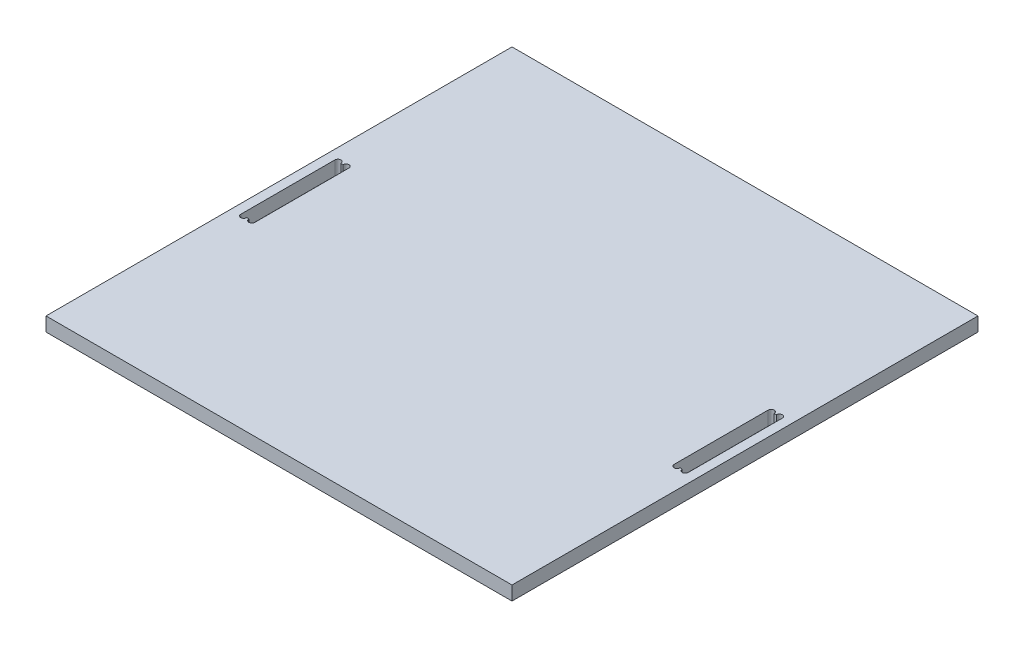
ISO-10303-21;
HEADER;
FILE_DESCRIPTION(('STEP AP214'),'2;1');
FILE_NAME('part.step','',(''),(''),'','','');
FILE_SCHEMA(('AUTOMOTIVE_DESIGN { 1 0 10303 214 1 1 1 1 }'));
ENDSEC;
DATA;
#1=APPLICATION_CONTEXT('core data for automotive mechanical design processes');
#2=APPLICATION_PROTOCOL_DEFINITION('international standard','automotive_design',2000,#1);
#3=PRODUCT_CONTEXT('',#1,'mechanical');
#4=PRODUCT('Part','Part','',(#3));
#5=PRODUCT_RELATED_PRODUCT_CATEGORY('part','',(#4));
#6=PRODUCT_DEFINITION_FORMATION('','',#4);
#7=PRODUCT_DEFINITION_CONTEXT('part definition',#1,'design');
#8=PRODUCT_DEFINITION('design','',#6,#7);
#9=PRODUCT_DEFINITION_SHAPE('','',#8);
#10=(LENGTH_UNIT() NAMED_UNIT(*) SI_UNIT(.MILLI.,.METRE.));
#11=(NAMED_UNIT(*) PLANE_ANGLE_UNIT() SI_UNIT($,.RADIAN.));
#12=(NAMED_UNIT(*) SI_UNIT($,.STERADIAN.) SOLID_ANGLE_UNIT());
#13=UNCERTAINTY_MEASURE_WITH_UNIT(LENGTH_MEASURE(1.E-05),#10,'distance_accuracy_value','');
#14=(GEOMETRIC_REPRESENTATION_CONTEXT(3) GLOBAL_UNCERTAINTY_ASSIGNED_CONTEXT((#13)) GLOBAL_UNIT_ASSIGNED_CONTEXT((#10,
#11,#12)) REPRESENTATION_CONTEXT('',''));
#15=CARTESIAN_POINT('',(0.,0.,0.));
#16=DIRECTION('',(0.,0.,1.));
#17=DIRECTION('',(1.,0.,0.));
#18=AXIS2_PLACEMENT_3D('',#15,#16,#17);
#19=CARTESIAN_POINT('',(-250.,15.,-250.));
#20=DIRECTION('',(0.,0.,-1.));
#21=DIRECTION('',(-1.,0.,0.));
#22=AXIS2_PLACEMENT_3D('',#19,#20,#21);
#23=PLANE('',#22);
#24=DIRECTION('',(1.,0.,0.));
#25=VECTOR('',#24,1.);
#26=CARTESIAN_POINT('',(-250.,0.,-250.));
#27=LINE('',#26,#25);
#28=CARTESIAN_POINT('',(-250.,0.,-250.));
#29=VERTEX_POINT('',#28);
#30=CARTESIAN_POINT('',(250.,0.,-250.));
#31=VERTEX_POINT('',#30);
#32=EDGE_CURVE('E218',#29,#31,#27,.T.);
#33=ORIENTED_EDGE('',*,*,#32,.F.);
#34=DIRECTION('',(0.,-1.,0.));
#35=VECTOR('',#34,1.);
#36=CARTESIAN_POINT('',(-250.,15.,-250.));
#37=LINE('',#36,#35);
#38=CARTESIAN_POINT('',(-250.,15.,-250.));
#39=VERTEX_POINT('',#38);
#40=EDGE_CURVE('E195',#39,#29,#37,.T.);
#41=ORIENTED_EDGE('',*,*,#40,.F.);
#42=DIRECTION('',(1.,0.,0.));
#43=VECTOR('',#42,1.);
#44=CARTESIAN_POINT('',(-250.,15.,-250.));
#45=LINE('',#44,#43);
#46=CARTESIAN_POINT('',(250.,15.,-250.));
#47=VERTEX_POINT('',#46);
#48=EDGE_CURVE('E260',#39,#47,#45,.T.);
#49=ORIENTED_EDGE('',*,*,#48,.T.);
#50=DIRECTION('',(0.,-1.,0.));
#51=VECTOR('',#50,1.);
#52=CARTESIAN_POINT('',(250.,15.,-250.));
#53=LINE('',#52,#51);
#54=EDGE_CURVE('E271',#47,#31,#53,.T.);
#55=ORIENTED_EDGE('',*,*,#54,.T.);
#56=EDGE_LOOP('',(#33,#41,#49,#55));
#57=FACE_BOUND('',#56,.T.);
#58=ADVANCED_FACE('F38',(#57),#23,.T.);
#59=CARTESIAN_POINT('',(-250.,15.,-250.));
#60=DIRECTION('',(1.,0.,0.));
#61=DIRECTION('',(0.,0.,-1.));
#62=AXIS2_PLACEMENT_3D('',#59,#60,#61);
#63=PLANE('',#62);
#64=DIRECTION('',(0.,0.,1.));
#65=VECTOR('',#64,1.);
#66=CARTESIAN_POINT('',(-250.,0.,-250.));
#67=LINE('',#66,#65);
#68=CARTESIAN_POINT('',(-250.,0.,250.));
#69=VERTEX_POINT('',#68);
#70=EDGE_CURVE('E264',#29,#69,#67,.T.);
#71=ORIENTED_EDGE('',*,*,#70,.T.);
#72=DIRECTION('',(0.,-1.,0.));
#73=VECTOR('',#72,1.);
#74=CARTESIAN_POINT('',(-250.,15.,250.));
#75=LINE('',#74,#73);
#76=CARTESIAN_POINT('',(-250.,15.,250.));
#77=VERTEX_POINT('',#76);
#78=EDGE_CURVE('E282',#77,#69,#75,.T.);
#79=ORIENTED_EDGE('',*,*,#78,.F.);
#80=DIRECTION('',(0.,0.,1.));
#81=VECTOR('',#80,1.);
#82=CARTESIAN_POINT('',(-250.,15.,-250.));
#83=LINE('',#82,#81);
#84=EDGE_CURVE('E269',#39,#77,#83,.T.);
#85=ORIENTED_EDGE('',*,*,#84,.F.);
#86=ORIENTED_EDGE('',*,*,#40,.T.);
#87=EDGE_LOOP('',(#71,#79,#85,#86));
#88=FACE_BOUND('',#87,.T.);
#89=ADVANCED_FACE('F376',(#88),#63,.F.);
#90=CARTESIAN_POINT('',(-250.,15.,250.));
#91=DIRECTION('',(0.,0.,-1.));
#92=DIRECTION('',(-1.,0.,0.));
#93=AXIS2_PLACEMENT_3D('',#90,#91,#92);
#94=PLANE('',#93);
#95=DIRECTION('',(1.,0.,0.));
#96=VECTOR('',#95,1.);
#97=CARTESIAN_POINT('',(-250.,0.,250.));
#98=LINE('',#97,#96);
#99=CARTESIAN_POINT('',(250.,0.,250.));
#100=VERTEX_POINT('',#99);
#101=EDGE_CURVE('E277',#69,#100,#98,.T.);
#102=ORIENTED_EDGE('',*,*,#101,.T.);
#103=DIRECTION('',(0.,-1.,0.));
#104=VECTOR('',#103,1.);
#105=CARTESIAN_POINT('',(250.,15.,250.));
#106=LINE('',#105,#104);
#107=CARTESIAN_POINT('',(250.,15.,250.));
#108=VERTEX_POINT('',#107);
#109=EDGE_CURVE('E285',#108,#100,#106,.T.);
#110=ORIENTED_EDGE('',*,*,#109,.F.);
#111=DIRECTION('',(1.,0.,0.));
#112=VECTOR('',#111,1.);
#113=CARTESIAN_POINT('',(-250.,15.,250.));
#114=LINE('',#113,#112);
#115=EDGE_CURVE('E267',#77,#108,#114,.T.);
#116=ORIENTED_EDGE('',*,*,#115,.F.);
#117=ORIENTED_EDGE('',*,*,#78,.T.);
#118=EDGE_LOOP('',(#102,#110,#116,#117));
#119=FACE_BOUND('',#118,.T.);
#120=ADVANCED_FACE('F381',(#119),#94,.F.);
#121=CARTESIAN_POINT('',(250.,15.,-250.));
#122=DIRECTION('',(1.,0.,0.));
#123=DIRECTION('',(0.,0.,-1.));
#124=AXIS2_PLACEMENT_3D('',#121,#122,#123);
#125=PLANE('',#124);
#126=DIRECTION('',(0.,0.,1.));
#127=VECTOR('',#126,1.);
#128=CARTESIAN_POINT('',(250.,0.,-250.));
#129=LINE('',#128,#127);
#130=EDGE_CURVE('E274',#31,#100,#129,.T.);
#131=ORIENTED_EDGE('',*,*,#130,.F.);
#132=ORIENTED_EDGE('',*,*,#54,.F.);
#133=DIRECTION('',(0.,0.,1.));
#134=VECTOR('',#133,1.);
#135=CARTESIAN_POINT('',(250.,15.,-250.));
#136=LINE('',#135,#134);
#137=EDGE_CURVE('E263',#47,#108,#136,.T.);
#138=ORIENTED_EDGE('',*,*,#137,.T.);
#139=ORIENTED_EDGE('',*,*,#109,.T.);
#140=EDGE_LOOP('',(#131,#132,#138,#139));
#141=FACE_BOUND('',#140,.T.);
#142=ADVANCED_FACE('F397',(#141),#125,.T.);
#143=CARTESIAN_POINT('',(0.,15.,0.));
#144=DIRECTION('',(0.,-1.,0.));
#145=DIRECTION('',(0.,0.,-1.));
#146=AXIS2_PLACEMENT_3D('',#143,#144,#145);
#147=PLANE('',#146);
#148=DIRECTION('',(0.,0.,1.));
#149=VECTOR('',#148,1.);
#150=CARTESIAN_POINT('',(-240.,15.,-50.));
#151=LINE('',#150,#149);
#152=CARTESIAN_POINT('',(-240.,15.,-50.));
#153=VERTEX_POINT('',#152);
#154=CARTESIAN_POINT('',(-240.,15.,51.));
#155=VERTEX_POINT('',#154);
#156=EDGE_CURVE('E202',#153,#155,#151,.T.);
#157=ORIENTED_EDGE('',*,*,#156,.F.);
#158=CARTESIAN_POINT('',(-236.825,15.,-50.));
#159=DIRECTION('',(0.,1.,0.));
#160=DIRECTION('',(0.,0.,-1.));
#161=AXIS2_PLACEMENT_3D('',#158,#159,#160);
#162=CIRCLE('',#161,3.17499999999997);
#163=CARTESIAN_POINT('',(-233.65,15.,-50.));
#164=VERTEX_POINT('',#163);
#165=EDGE_CURVE('E201',#164,#153,#162,.T.);
#166=ORIENTED_EDGE('',*,*,#165,.F.);
#167=DIRECTION('',(-1.,0.,0.));
#168=VECTOR('',#167,1.);
#169=CARTESIAN_POINT('',(-240.,15.,-50.));
#170=LINE('',#169,#168);
#171=CARTESIAN_POINT('',(-231.25,15.,-50.));
#172=VERTEX_POINT('',#171);
#173=EDGE_CURVE('E191',#172,#164,#170,.T.);
#174=ORIENTED_EDGE('',*,*,#173,.F.);
#175=CARTESIAN_POINT('',(-228.075,15.,-50.));
#176=DIRECTION('',(0.,1.,0.));
#177=DIRECTION('',(0.,0.,-1.));
#178=AXIS2_PLACEMENT_3D('',#175,#176,#177);
#179=CIRCLE('',#178,3.17499999999997);
#180=CARTESIAN_POINT('',(-224.9,15.,-50.));
#181=VERTEX_POINT('',#180);
#182=EDGE_CURVE('E172',#181,#172,#179,.T.);
#183=ORIENTED_EDGE('',*,*,#182,.F.);
#184=DIRECTION('',(0.,0.,-1.));
#185=VECTOR('',#184,1.);
#186=CARTESIAN_POINT('',(-224.9,15.,-50.));
#187=LINE('',#186,#185);
#188=CARTESIAN_POINT('',(-224.9,15.,51.));
#189=VERTEX_POINT('',#188);
#190=EDGE_CURVE('E203',#189,#181,#187,.T.);
#191=ORIENTED_EDGE('',*,*,#190,.F.);
#192=CARTESIAN_POINT('',(-228.1,15.,51.));
#193=DIRECTION('',(0.,1.,0.));
#194=DIRECTION('',(0.,0.,1.));
#195=AXIS2_PLACEMENT_3D('',#192,#193,#194);
#196=CIRCLE('',#195,3.20000000000001);
#197=CARTESIAN_POINT('',(-231.3,15.,51.));
#198=VERTEX_POINT('',#197);
#199=EDGE_CURVE('E325',#198,#189,#196,.T.);
#200=ORIENTED_EDGE('',*,*,#199,.F.);
#201=DIRECTION('',(1.,0.,0.));
#202=VECTOR('',#201,1.);
#203=CARTESIAN_POINT('',(-240.,15.,51.));
#204=LINE('',#203,#202);
#205=CARTESIAN_POINT('',(-233.6,15.,51.));
#206=VERTEX_POINT('',#205);
#207=EDGE_CURVE('E206',#206,#198,#204,.T.);
#208=ORIENTED_EDGE('',*,*,#207,.F.);
#209=CARTESIAN_POINT('',(-236.8,15.,51.));
#210=DIRECTION('',(0.,1.,0.));
#211=DIRECTION('',(0.,0.,1.));
#212=AXIS2_PLACEMENT_3D('',#209,#210,#211);
#213=CIRCLE('',#212,3.20000000000001);
#214=EDGE_CURVE('E326',#155,#206,#213,.T.);
#215=ORIENTED_EDGE('',*,*,#214,.F.);
#216=EDGE_LOOP('',(#157,#166,#174,#183,#191,#200,#208,#215));
#217=FACE_BOUND('',#216,.T.);
#218=DIRECTION('',(0.,0.,-1.));
#219=VECTOR('',#218,1.);
#220=CARTESIAN_POINT('',(240.,15.,-50.));
#221=LINE('',#220,#219);
#222=CARTESIAN_POINT('',(240.,15.,51.));
#223=VERTEX_POINT('',#222);
#224=CARTESIAN_POINT('',(240.,15.,-50.));
#225=VERTEX_POINT('',#224);
#226=EDGE_CURVE('E240',#223,#225,#221,.T.);
#227=ORIENTED_EDGE('',*,*,#226,.F.);
#228=CARTESIAN_POINT('',(236.8,15.,51.));
#229=DIRECTION('',(0.,1.,0.));
#230=DIRECTION('',(0.,0.,-1.));
#231=AXIS2_PLACEMENT_3D('',#228,#229,#230);
#232=CIRCLE('',#231,3.20000000000001);
#233=CARTESIAN_POINT('',(233.6,15.,51.));
#234=VERTEX_POINT('',#233);
#235=EDGE_CURVE('E319',#234,#223,#232,.T.);
#236=ORIENTED_EDGE('',*,*,#235,.F.);
#237=DIRECTION('',(1.,0.,0.));
#238=VECTOR('',#237,1.);
#239=CARTESIAN_POINT('',(240.,15.,51.));
#240=LINE('',#239,#238);
#241=CARTESIAN_POINT('',(231.3,15.,51.));
#242=VERTEX_POINT('',#241);
#243=EDGE_CURVE('E230',#242,#234,#240,.T.);
#244=ORIENTED_EDGE('',*,*,#243,.F.);
#245=CARTESIAN_POINT('',(228.1,15.,51.));
#246=DIRECTION('',(0.,1.,0.));
#247=DIRECTION('',(0.,0.,-1.));
#248=AXIS2_PLACEMENT_3D('',#245,#246,#247);
#249=CIRCLE('',#248,3.20000000000001);
#250=CARTESIAN_POINT('',(224.9,15.,51.));
#251=VERTEX_POINT('',#250);
#252=EDGE_CURVE('E491',#251,#242,#249,.T.);
#253=ORIENTED_EDGE('',*,*,#252,.F.);
#254=DIRECTION('',(0.,0.,1.));
#255=VECTOR('',#254,1.);
#256=CARTESIAN_POINT('',(224.9,15.,-50.));
#257=LINE('',#256,#255);
#258=CARTESIAN_POINT('',(224.9,15.,-50.));
#259=VERTEX_POINT('',#258);
#260=EDGE_CURVE('E247',#259,#251,#257,.T.);
#261=ORIENTED_EDGE('',*,*,#260,.F.);
#262=CARTESIAN_POINT('',(228.075,15.,-50.));
#263=DIRECTION('',(0.,1.,0.));
#264=DIRECTION('',(0.,0.,1.));
#265=AXIS2_PLACEMENT_3D('',#262,#263,#264);
#266=CIRCLE('',#265,3.17499999999997);
#267=CARTESIAN_POINT('',(231.25,15.,-50.));
#268=VERTEX_POINT('',#267);
#269=EDGE_CURVE('E308',#268,#259,#266,.T.);
#270=ORIENTED_EDGE('',*,*,#269,.F.);
#271=DIRECTION('',(-1.,0.,0.));
#272=VECTOR('',#271,1.);
#273=CARTESIAN_POINT('',(240.,15.,-50.));
#274=LINE('',#273,#272);
#275=CARTESIAN_POINT('',(233.65,15.,-50.));
#276=VERTEX_POINT('',#275);
#277=EDGE_CURVE('E243',#276,#268,#274,.T.);
#278=ORIENTED_EDGE('',*,*,#277,.F.);
#279=CARTESIAN_POINT('',(236.825,15.,-50.));
#280=DIRECTION('',(0.,1.,0.));
#281=DIRECTION('',(0.,0.,1.));
#282=AXIS2_PLACEMENT_3D('',#279,#280,#281);
#283=CIRCLE('',#282,3.17499999999997);
#284=EDGE_CURVE('E309',#225,#276,#283,.T.);
#285=ORIENTED_EDGE('',*,*,#284,.F.);
#286=EDGE_LOOP('',(#227,#236,#244,#253,#261,#270,#278,#285));
#287=FACE_BOUND('',#286,.T.);
#288=ORIENTED_EDGE('',*,*,#48,.F.);
#289=ORIENTED_EDGE('',*,*,#84,.T.);
#290=ORIENTED_EDGE('',*,*,#115,.T.);
#291=ORIENTED_EDGE('',*,*,#137,.F.);
#292=EDGE_LOOP('',(#288,#289,#290,#291));
#293=FACE_BOUND('',#292,.T.);
#294=ADVANCED_FACE('F199',(#217,#287,#293),#147,.F.);
#295=CARTESIAN_POINT('',(0.,0.,0.));
#296=DIRECTION('',(0.,-1.,0.));
#297=DIRECTION('',(0.,0.,-1.));
#298=AXIS2_PLACEMENT_3D('',#295,#296,#297);
#299=PLANE('',#298);
#300=CARTESIAN_POINT('',(236.8,0.,51.));
#301=DIRECTION('',(0.,1.,0.));
#302=DIRECTION('',(0.,0.,-1.));
#303=AXIS2_PLACEMENT_3D('',#300,#301,#302);
#304=CIRCLE('',#303,3.20000000000001);
#305=CARTESIAN_POINT('',(233.6,0.,51.));
#306=VERTEX_POINT('',#305);
#307=CARTESIAN_POINT('',(240.,0.,51.));
#308=VERTEX_POINT('',#307);
#309=EDGE_CURVE('E52',#306,#308,#304,.T.);
#310=ORIENTED_EDGE('',*,*,#309,.T.);
#311=DIRECTION('',(0.,0.,-1.));
#312=VECTOR('',#311,1.);
#313=CARTESIAN_POINT('',(240.,0.,-50.));
#314=LINE('',#313,#312);
#315=CARTESIAN_POINT('',(240.,0.,-50.));
#316=VERTEX_POINT('',#315);
#317=EDGE_CURVE('E226',#308,#316,#314,.T.);
#318=ORIENTED_EDGE('',*,*,#317,.T.);
#319=CARTESIAN_POINT('',(236.825,0.,-50.));
#320=DIRECTION('',(0.,1.,0.));
#321=DIRECTION('',(0.,0.,1.));
#322=AXIS2_PLACEMENT_3D('',#319,#320,#321);
#323=CIRCLE('',#322,3.17499999999997);
#324=CARTESIAN_POINT('',(233.65,0.,-50.));
#325=VERTEX_POINT('',#324);
#326=EDGE_CURVE('E304',#316,#325,#323,.T.);
#327=ORIENTED_EDGE('',*,*,#326,.T.);
#328=DIRECTION('',(-1.,0.,0.));
#329=VECTOR('',#328,1.);
#330=CARTESIAN_POINT('',(240.,0.,-50.));
#331=LINE('',#330,#329);
#332=CARTESIAN_POINT('',(231.25,0.,-50.));
#333=VERTEX_POINT('',#332);
#334=EDGE_CURVE('E229',#325,#333,#331,.T.);
#335=ORIENTED_EDGE('',*,*,#334,.T.);
#336=CARTESIAN_POINT('',(228.075,0.,-50.));
#337=DIRECTION('',(0.,1.,0.));
#338=DIRECTION('',(0.,0.,1.));
#339=AXIS2_PLACEMENT_3D('',#336,#337,#338);
#340=CIRCLE('',#339,3.17499999999997);
#341=CARTESIAN_POINT('',(224.9,0.,-50.));
#342=VERTEX_POINT('',#341);
#343=EDGE_CURVE('E59',#333,#342,#340,.T.);
#344=ORIENTED_EDGE('',*,*,#343,.T.);
#345=DIRECTION('',(0.,0.,1.));
#346=VECTOR('',#345,1.);
#347=CARTESIAN_POINT('',(224.9,0.,-50.));
#348=LINE('',#347,#346);
#349=CARTESIAN_POINT('',(224.9,0.,51.));
#350=VERTEX_POINT('',#349);
#351=EDGE_CURVE('E233',#342,#350,#348,.T.);
#352=ORIENTED_EDGE('',*,*,#351,.T.);
#353=CARTESIAN_POINT('',(228.1,0.,51.));
#354=DIRECTION('',(0.,1.,0.));
#355=DIRECTION('',(0.,0.,-1.));
#356=AXIS2_PLACEMENT_3D('',#353,#354,#355);
#357=CIRCLE('',#356,3.20000000000001);
#358=CARTESIAN_POINT('',(231.3,0.,51.));
#359=VERTEX_POINT('',#358);
#360=EDGE_CURVE('E321',#350,#359,#357,.T.);
#361=ORIENTED_EDGE('',*,*,#360,.T.);
#362=DIRECTION('',(1.,0.,0.));
#363=VECTOR('',#362,1.);
#364=CARTESIAN_POINT('',(240.,0.,51.));
#365=LINE('',#364,#363);
#366=EDGE_CURVE('E236',#359,#306,#365,.T.);
#367=ORIENTED_EDGE('',*,*,#366,.T.);
#368=EDGE_LOOP('',(#310,#318,#327,#335,#344,#352,#361,#367));
#369=FACE_BOUND('',#368,.T.);
#370=CARTESIAN_POINT('',(-236.825,0.,-50.));
#371=DIRECTION('',(0.,1.,0.));
#372=DIRECTION('',(0.,0.,-1.));
#373=AXIS2_PLACEMENT_3D('',#370,#371,#372);
#374=CIRCLE('',#373,3.17499999999997);
#375=CARTESIAN_POINT('',(-233.65,0.,-50.));
#376=VERTEX_POINT('',#375);
#377=CARTESIAN_POINT('',(-240.,0.,-50.));
#378=VERTEX_POINT('',#377);
#379=EDGE_CURVE('E184',#376,#378,#374,.T.);
#380=ORIENTED_EDGE('',*,*,#379,.T.);
#381=DIRECTION('',(0.,0.,1.));
#382=VECTOR('',#381,1.);
#383=CARTESIAN_POINT('',(-240.,0.,-50.));
#384=LINE('',#383,#382);
#385=CARTESIAN_POINT('',(-240.,0.,51.));
#386=VERTEX_POINT('',#385);
#387=EDGE_CURVE('E341',#378,#386,#384,.T.);
#388=ORIENTED_EDGE('',*,*,#387,.T.);
#389=CARTESIAN_POINT('',(-236.8,0.,51.));
#390=DIRECTION('',(0.,1.,0.));
#391=DIRECTION('',(0.,0.,1.));
#392=AXIS2_PLACEMENT_3D('',#389,#390,#391);
#393=CIRCLE('',#392,3.20000000000001);
#394=CARTESIAN_POINT('',(-233.6,0.,51.));
#395=VERTEX_POINT('',#394);
#396=EDGE_CURVE('E322',#386,#395,#393,.T.);
#397=ORIENTED_EDGE('',*,*,#396,.T.);
#398=DIRECTION('',(1.,0.,0.));
#399=VECTOR('',#398,1.);
#400=CARTESIAN_POINT('',(-240.,0.,51.));
#401=LINE('',#400,#399);
#402=CARTESIAN_POINT('',(-231.3,0.,51.));
#403=VERTEX_POINT('',#402);
#404=EDGE_CURVE('E225',#395,#403,#401,.T.);
#405=ORIENTED_EDGE('',*,*,#404,.T.);
#406=CARTESIAN_POINT('',(-228.1,0.,51.));
#407=DIRECTION('',(0.,1.,0.));
#408=DIRECTION('',(0.,0.,1.));
#409=AXIS2_PLACEMENT_3D('',#406,#407,#408);
#410=CIRCLE('',#409,3.20000000000001);
#411=CARTESIAN_POINT('',(-224.9,0.,51.));
#412=VERTEX_POINT('',#411);
#413=EDGE_CURVE('E329',#403,#412,#410,.T.);
#414=ORIENTED_EDGE('',*,*,#413,.T.);
#415=DIRECTION('',(0.,0.,-1.));
#416=VECTOR('',#415,1.);
#417=CARTESIAN_POINT('',(-224.9,0.,-50.));
#418=LINE('',#417,#416);
#419=CARTESIAN_POINT('',(-224.9,0.,-50.));
#420=VERTEX_POINT('',#419);
#421=EDGE_CURVE('E214',#412,#420,#418,.T.);
#422=ORIENTED_EDGE('',*,*,#421,.T.);
#423=CARTESIAN_POINT('',(-228.075,0.,-50.));
#424=DIRECTION('',(0.,1.,0.));
#425=DIRECTION('',(0.,0.,-1.));
#426=AXIS2_PLACEMENT_3D('',#423,#424,#425);
#427=CIRCLE('',#426,3.17499999999997);
#428=CARTESIAN_POINT('',(-231.25,0.,-50.));
#429=VERTEX_POINT('',#428);
#430=EDGE_CURVE('E183',#420,#429,#427,.T.);
#431=ORIENTED_EDGE('',*,*,#430,.T.);
#432=DIRECTION('',(-1.,0.,0.));
#433=VECTOR('',#432,1.);
#434=CARTESIAN_POINT('',(-240.,0.,-50.));
#435=LINE('',#434,#433);
#436=EDGE_CURVE('E193',#429,#376,#435,.T.);
#437=ORIENTED_EDGE('',*,*,#436,.T.);
#438=EDGE_LOOP('',(#380,#388,#397,#405,#414,#422,#431,#437));
#439=FACE_BOUND('',#438,.T.);
#440=ORIENTED_EDGE('',*,*,#32,.T.);
#441=ORIENTED_EDGE('',*,*,#130,.T.);
#442=ORIENTED_EDGE('',*,*,#101,.F.);
#443=ORIENTED_EDGE('',*,*,#70,.F.);
#444=EDGE_LOOP('',(#440,#441,#442,#443));
#445=FACE_BOUND('',#444,.T.);
#446=ADVANCED_FACE('F301',(#369,#439,#445),#299,.T.);
#447=CARTESIAN_POINT('',(240.,0.,-50.));
#448=DIRECTION('',(1.,0.,0.));
#449=DIRECTION('',(0.,0.,-1.));
#450=AXIS2_PLACEMENT_3D('',#447,#448,#449);
#451=PLANE('',#450);
#452=ORIENTED_EDGE('',*,*,#226,.T.);
#453=DIRECTION('',(0.,1.,0.));
#454=VECTOR('',#453,1.);
#455=CARTESIAN_POINT('',(240.,0.,-50.));
#456=LINE('',#455,#454);
#457=EDGE_CURVE('E239',#316,#225,#456,.T.);
#458=ORIENTED_EDGE('',*,*,#457,.F.);
#459=ORIENTED_EDGE('',*,*,#317,.F.);
#460=DIRECTION('',(0.,1.,0.));
#461=VECTOR('',#460,1.);
#462=CARTESIAN_POINT('',(240.,0.,51.));
#463=LINE('',#462,#461);
#464=EDGE_CURVE('E208',#308,#223,#463,.T.);
#465=ORIENTED_EDGE('',*,*,#464,.T.);
#466=EDGE_LOOP('',(#452,#458,#459,#465));
#467=FACE_BOUND('',#466,.T.);
#468=ADVANCED_FACE('F407',(#467),#451,.F.);
#469=CARTESIAN_POINT('',(240.,0.,51.));
#470=DIRECTION('',(0.,0.,1.));
#471=DIRECTION('',(1.,0.,0.));
#472=AXIS2_PLACEMENT_3D('',#469,#470,#471);
#473=PLANE('',#472);
#474=ORIENTED_EDGE('',*,*,#243,.T.);
#475=DIRECTION('',(0.,1.,0.));
#476=VECTOR('',#475,1.);
#477=CARTESIAN_POINT('',(233.6,0.,51.));
#478=LINE('',#477,#476);
#479=EDGE_CURVE('E11',#234,#306,#478,.F.);
#480=ORIENTED_EDGE('',*,*,#479,.T.);
#481=ORIENTED_EDGE('',*,*,#366,.F.);
#482=DIRECTION('',(0.,1.,0.));
#483=VECTOR('',#482,1.);
#484=CARTESIAN_POINT('',(231.3,0.,51.));
#485=LINE('',#484,#483);
#486=EDGE_CURVE('E244',#359,#242,#485,.T.);
#487=ORIENTED_EDGE('',*,*,#486,.T.);
#488=EDGE_LOOP('',(#474,#480,#481,#487));
#489=FACE_BOUND('',#488,.T.);
#490=ADVANCED_FACE('F411',(#489),#473,.F.);
#491=CARTESIAN_POINT('',(224.9,0.,-50.));
#492=DIRECTION('',(-1.,0.,0.));
#493=DIRECTION('',(0.,0.,1.));
#494=AXIS2_PLACEMENT_3D('',#491,#492,#493);
#495=PLANE('',#494);
#496=ORIENTED_EDGE('',*,*,#260,.T.);
#497=DIRECTION('',(0.,1.,0.));
#498=VECTOR('',#497,1.);
#499=CARTESIAN_POINT('',(224.9,0.,51.));
#500=LINE('',#499,#498);
#501=EDGE_CURVE('E254',#350,#251,#500,.T.);
#502=ORIENTED_EDGE('',*,*,#501,.F.);
#503=ORIENTED_EDGE('',*,*,#351,.F.);
#504=DIRECTION('',(0.,1.,0.));
#505=VECTOR('',#504,1.);
#506=CARTESIAN_POINT('',(224.9,0.,-50.));
#507=LINE('',#506,#505);
#508=EDGE_CURVE('E256',#342,#259,#507,.T.);
#509=ORIENTED_EDGE('',*,*,#508,.T.);
#510=EDGE_LOOP('',(#496,#502,#503,#509));
#511=FACE_BOUND('',#510,.T.);
#512=ADVANCED_FACE('F415',(#511),#495,.F.);
#513=CARTESIAN_POINT('',(240.,0.,-50.));
#514=DIRECTION('',(0.,0.,-1.));
#515=DIRECTION('',(-1.,0.,0.));
#516=AXIS2_PLACEMENT_3D('',#513,#514,#515);
#517=PLANE('',#516);
#518=ORIENTED_EDGE('',*,*,#277,.T.);
#519=DIRECTION('',(0.,1.,0.));
#520=VECTOR('',#519,1.);
#521=CARTESIAN_POINT('',(231.25,0.,-50.));
#522=LINE('',#521,#520);
#523=EDGE_CURVE('E45',#268,#333,#522,.F.);
#524=ORIENTED_EDGE('',*,*,#523,.T.);
#525=ORIENTED_EDGE('',*,*,#334,.F.);
#526=DIRECTION('',(0.,1.,0.));
#527=VECTOR('',#526,1.);
#528=CARTESIAN_POINT('',(233.65,0.,-50.));
#529=LINE('',#528,#527);
#530=EDGE_CURVE('E292',#325,#276,#529,.T.);
#531=ORIENTED_EDGE('',*,*,#530,.T.);
#532=EDGE_LOOP('',(#518,#524,#525,#531));
#533=FACE_BOUND('',#532,.T.);
#534=ADVANCED_FACE('F296',(#533),#517,.F.);
#535=CARTESIAN_POINT('',(-224.9,0.,-50.));
#536=DIRECTION('',(1.,0.,0.));
#537=DIRECTION('',(0.,0.,-1.));
#538=AXIS2_PLACEMENT_3D('',#535,#536,#537);
#539=PLANE('',#538);
#540=ORIENTED_EDGE('',*,*,#190,.T.);
#541=DIRECTION('',(0.,1.,0.));
#542=VECTOR('',#541,1.);
#543=CARTESIAN_POINT('',(-224.9,0.,-50.));
#544=LINE('',#543,#542);
#545=EDGE_CURVE('E178',#420,#181,#544,.T.);
#546=ORIENTED_EDGE('',*,*,#545,.F.);
#547=ORIENTED_EDGE('',*,*,#421,.F.);
#548=DIRECTION('',(0.,1.,0.));
#549=VECTOR('',#548,1.);
#550=CARTESIAN_POINT('',(-224.9,0.,51.));
#551=LINE('',#550,#549);
#552=EDGE_CURVE('E215',#412,#189,#551,.T.);
#553=ORIENTED_EDGE('',*,*,#552,.T.);
#554=EDGE_LOOP('',(#540,#546,#547,#553));
#555=FACE_BOUND('',#554,.T.);
#556=ADVANCED_FACE('F355',(#555),#539,.F.);
#557=CARTESIAN_POINT('',(-240.,0.,51.));
#558=DIRECTION('',(0.,0.,1.));
#559=DIRECTION('',(1.,0.,0.));
#560=AXIS2_PLACEMENT_3D('',#557,#558,#559);
#561=PLANE('',#560);
#562=ORIENTED_EDGE('',*,*,#404,.F.);
#563=DIRECTION('',(0.,1.,0.));
#564=VECTOR('',#563,1.);
#565=CARTESIAN_POINT('',(-233.6,0.,51.));
#566=LINE('',#565,#564);
#567=EDGE_CURVE('E332',#395,#206,#566,.T.);
#568=ORIENTED_EDGE('',*,*,#567,.T.);
#569=ORIENTED_EDGE('',*,*,#207,.T.);
#570=DIRECTION('',(0.,1.,0.));
#571=VECTOR('',#570,1.);
#572=CARTESIAN_POINT('',(-231.3,0.,51.));
#573=LINE('',#572,#571);
#574=EDGE_CURVE('E289',#198,#403,#573,.F.);
#575=ORIENTED_EDGE('',*,*,#574,.T.);
#576=EDGE_LOOP('',(#562,#568,#569,#575));
#577=FACE_BOUND('',#576,.T.);
#578=ADVANCED_FACE('F348',(#577),#561,.F.);
#579=CARTESIAN_POINT('',(-240.,0.,-50.));
#580=DIRECTION('',(-1.,0.,0.));
#581=DIRECTION('',(0.,0.,1.));
#582=AXIS2_PLACEMENT_3D('',#579,#580,#581);
#583=PLANE('',#582);
#584=ORIENTED_EDGE('',*,*,#156,.T.);
#585=DIRECTION('',(0.,1.,0.));
#586=VECTOR('',#585,1.);
#587=CARTESIAN_POINT('',(-240.,0.,51.));
#588=LINE('',#587,#586);
#589=EDGE_CURVE('E219',#386,#155,#588,.T.);
#590=ORIENTED_EDGE('',*,*,#589,.F.);
#591=ORIENTED_EDGE('',*,*,#387,.F.);
#592=DIRECTION('',(0.,1.,0.));
#593=VECTOR('',#592,1.);
#594=CARTESIAN_POINT('',(-240.,0.,-50.));
#595=LINE('',#594,#593);
#596=EDGE_CURVE('E221',#378,#153,#595,.T.);
#597=ORIENTED_EDGE('',*,*,#596,.T.);
#598=EDGE_LOOP('',(#584,#590,#591,#597));
#599=FACE_BOUND('',#598,.T.);
#600=ADVANCED_FACE('F360',(#599),#583,.F.);
#601=CARTESIAN_POINT('',(-240.,0.,-50.));
#602=DIRECTION('',(0.,0.,-1.));
#603=DIRECTION('',(-1.,0.,0.));
#604=AXIS2_PLACEMENT_3D('',#601,#602,#603);
#605=PLANE('',#604);
#606=ORIENTED_EDGE('',*,*,#173,.T.);
#607=DIRECTION('',(0.,1.,0.));
#608=VECTOR('',#607,1.);
#609=CARTESIAN_POINT('',(-233.65,0.,-50.));
#610=LINE('',#609,#608);
#611=EDGE_CURVE('E194',#164,#376,#610,.F.);
#612=ORIENTED_EDGE('',*,*,#611,.T.);
#613=ORIENTED_EDGE('',*,*,#436,.F.);
#614=DIRECTION('',(0.,1.,0.));
#615=VECTOR('',#614,1.);
#616=CARTESIAN_POINT('',(-231.25,0.,-50.));
#617=LINE('',#616,#615);
#618=EDGE_CURVE('E175',#429,#172,#617,.T.);
#619=ORIENTED_EDGE('',*,*,#618,.T.);
#620=EDGE_LOOP('',(#606,#612,#613,#619));
#621=FACE_BOUND('',#620,.T.);
#622=ADVANCED_FACE('F189',(#621),#605,.F.);
#623=CARTESIAN_POINT('',(-228.075,0.,-50.));
#624=DIRECTION('',(0.,1.,0.));
#625=DIRECTION('',(0.,0.,1.));
#626=AXIS2_PLACEMENT_3D('',#623,#624,#625);
#627=CYLINDRICAL_SURFACE('',#626,3.17499999999997);
#628=ORIENTED_EDGE('',*,*,#430,.F.);
#629=ORIENTED_EDGE('',*,*,#545,.T.);
#630=ORIENTED_EDGE('',*,*,#182,.T.);
#631=ORIENTED_EDGE('',*,*,#618,.F.);
#632=EDGE_LOOP('',(#628,#629,#630,#631));
#633=FACE_BOUND('',#632,.T.);
#634=ADVANCED_FACE('F174',(#633),#627,.F.);
#635=CARTESIAN_POINT('',(-236.825,0.,-50.));
#636=DIRECTION('',(0.,1.,0.));
#637=DIRECTION('',(0.,0.,1.));
#638=AXIS2_PLACEMENT_3D('',#635,#636,#637);
#639=CYLINDRICAL_SURFACE('',#638,3.17499999999997);
#640=ORIENTED_EDGE('',*,*,#379,.F.);
#641=ORIENTED_EDGE('',*,*,#611,.F.);
#642=ORIENTED_EDGE('',*,*,#165,.T.);
#643=ORIENTED_EDGE('',*,*,#596,.F.);
#644=EDGE_LOOP('',(#640,#641,#642,#643));
#645=FACE_BOUND('',#644,.T.);
#646=ADVANCED_FACE('F364',(#645),#639,.F.);
#647=CARTESIAN_POINT('',(-236.8,0.,51.));
#648=DIRECTION('',(0.,1.,0.));
#649=DIRECTION('',(0.,0.,1.));
#650=AXIS2_PLACEMENT_3D('',#647,#648,#649);
#651=CYLINDRICAL_SURFACE('',#650,3.20000000000001);
#652=ORIENTED_EDGE('',*,*,#396,.F.);
#653=ORIENTED_EDGE('',*,*,#589,.T.);
#654=ORIENTED_EDGE('',*,*,#214,.T.);
#655=ORIENTED_EDGE('',*,*,#567,.F.);
#656=EDGE_LOOP('',(#652,#653,#654,#655));
#657=FACE_BOUND('',#656,.T.);
#658=ADVANCED_FACE('F362',(#657),#651,.F.);
#659=CARTESIAN_POINT('',(-228.1,0.,51.));
#660=DIRECTION('',(0.,1.,0.));
#661=DIRECTION('',(0.,0.,1.));
#662=AXIS2_PLACEMENT_3D('',#659,#660,#661);
#663=CYLINDRICAL_SURFACE('',#662,3.20000000000001);
#664=ORIENTED_EDGE('',*,*,#413,.F.);
#665=ORIENTED_EDGE('',*,*,#574,.F.);
#666=ORIENTED_EDGE('',*,*,#199,.T.);
#667=ORIENTED_EDGE('',*,*,#552,.F.);
#668=EDGE_LOOP('',(#664,#665,#666,#667));
#669=FACE_BOUND('',#668,.T.);
#670=ADVANCED_FACE('F352',(#669),#663,.F.);
#671=CARTESIAN_POINT('',(236.825,0.,-50.));
#672=DIRECTION('',(0.,1.,0.));
#673=DIRECTION('',(0.,0.,1.));
#674=AXIS2_PLACEMENT_3D('',#671,#672,#673);
#675=CYLINDRICAL_SURFACE('',#674,3.17499999999997);
#676=ORIENTED_EDGE('',*,*,#326,.F.);
#677=ORIENTED_EDGE('',*,*,#457,.T.);
#678=ORIENTED_EDGE('',*,*,#284,.T.);
#679=ORIENTED_EDGE('',*,*,#530,.F.);
#680=EDGE_LOOP('',(#676,#677,#678,#679));
#681=FACE_BOUND('',#680,.T.);
#682=ADVANCED_FACE('F370',(#681),#675,.F.);
#683=CARTESIAN_POINT('',(228.075,0.,-50.));
#684=DIRECTION('',(0.,1.,0.));
#685=DIRECTION('',(0.,0.,1.));
#686=AXIS2_PLACEMENT_3D('',#683,#684,#685);
#687=CYLINDRICAL_SURFACE('',#686,3.17499999999997);
#688=ORIENTED_EDGE('',*,*,#343,.F.);
#689=ORIENTED_EDGE('',*,*,#523,.F.);
#690=ORIENTED_EDGE('',*,*,#269,.T.);
#691=ORIENTED_EDGE('',*,*,#508,.F.);
#692=EDGE_LOOP('',(#688,#689,#690,#691));
#693=FACE_BOUND('',#692,.T.);
#694=ADVANCED_FACE('F457',(#693),#687,.F.);
#695=CARTESIAN_POINT('',(228.1,0.,51.));
#696=DIRECTION('',(0.,1.,0.));
#697=DIRECTION('',(0.,0.,1.));
#698=AXIS2_PLACEMENT_3D('',#695,#696,#697);
#699=CYLINDRICAL_SURFACE('',#698,3.20000000000001);
#700=ORIENTED_EDGE('',*,*,#360,.F.);
#701=ORIENTED_EDGE('',*,*,#501,.T.);
#702=ORIENTED_EDGE('',*,*,#252,.T.);
#703=ORIENTED_EDGE('',*,*,#486,.F.);
#704=EDGE_LOOP('',(#700,#701,#702,#703));
#705=FACE_BOUND('',#704,.T.);
#706=ADVANCED_FACE('F466',(#705),#699,.F.);
#707=CARTESIAN_POINT('',(236.8,0.,51.));
#708=DIRECTION('',(0.,1.,0.));
#709=DIRECTION('',(0.,0.,1.));
#710=AXIS2_PLACEMENT_3D('',#707,#708,#709);
#711=CYLINDRICAL_SURFACE('',#710,3.20000000000001);
#712=ORIENTED_EDGE('',*,*,#309,.F.);
#713=ORIENTED_EDGE('',*,*,#479,.F.);
#714=ORIENTED_EDGE('',*,*,#235,.T.);
#715=ORIENTED_EDGE('',*,*,#464,.F.);
#716=EDGE_LOOP('',(#712,#713,#714,#715));
#717=FACE_BOUND('',#716,.T.);
#718=ADVANCED_FACE('F475',(#717),#711,.F.);
#719=CLOSED_SHELL('',(#58,#89,#120,#142,#294,#446,#468,#490,#512,#534,#556,#578,#600,#622,#634,
#646,#658,#670,#682,#694,#706,#718));
#720=MANIFOLD_SOLID_BREP('B2',#719);
#721=ADVANCED_BREP_SHAPE_REPRESENTATION('',(#18,#720),#14);
#722=SHAPE_DEFINITION_REPRESENTATION(#9,#721);
ENDSEC;
END-ISO-10303-21;
